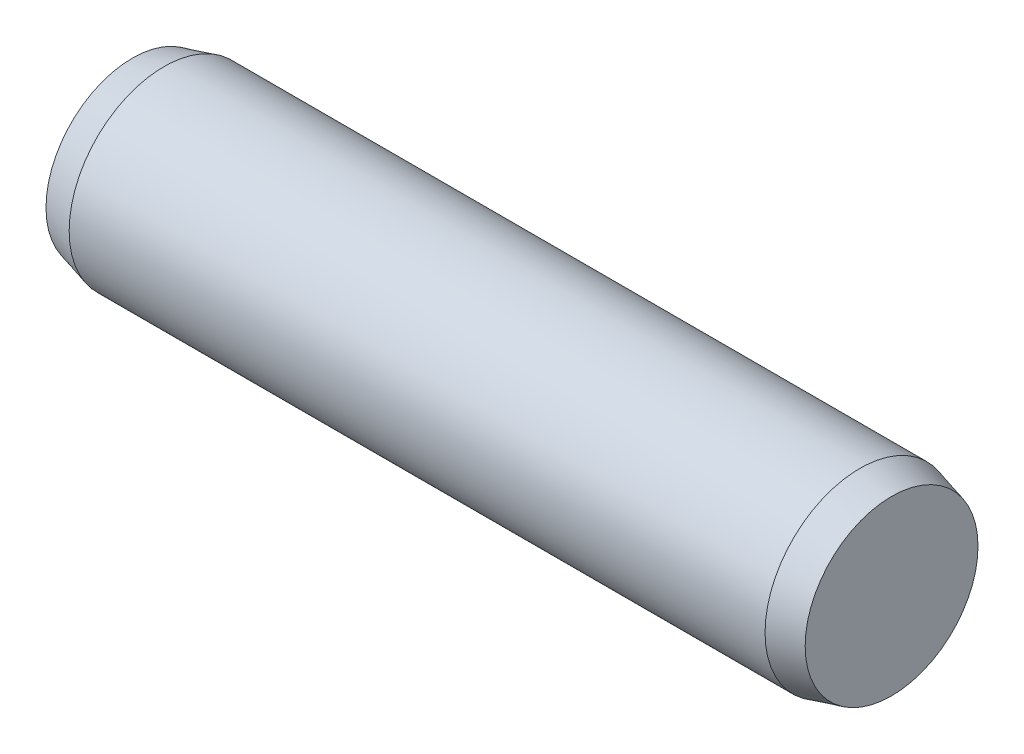
ISO-10303-21;
HEADER;
FILE_DESCRIPTION(('STEP AP214'),'2;1');
FILE_NAME('part.step','',(''),(''),'','','');
FILE_SCHEMA(('AUTOMOTIVE_DESIGN { 1 0 10303 214 1 1 1 1 }'));
ENDSEC;
DATA;
#1=APPLICATION_CONTEXT('core data for automotive mechanical design processes');
#2=APPLICATION_PROTOCOL_DEFINITION('international standard','automotive_design',2000,#1);
#3=PRODUCT_CONTEXT('',#1,'mechanical');
#4=PRODUCT('Part','Part','',(#3));
#5=PRODUCT_RELATED_PRODUCT_CATEGORY('part','',(#4));
#6=PRODUCT_DEFINITION_FORMATION('','',#4);
#7=PRODUCT_DEFINITION_CONTEXT('part definition',#1,'design');
#8=PRODUCT_DEFINITION('design','',#6,#7);
#9=PRODUCT_DEFINITION_SHAPE('','',#8);
#10=(LENGTH_UNIT() NAMED_UNIT(*) SI_UNIT(.MILLI.,.METRE.));
#11=(NAMED_UNIT(*) PLANE_ANGLE_UNIT() SI_UNIT($,.RADIAN.));
#12=(NAMED_UNIT(*) SI_UNIT($,.STERADIAN.) SOLID_ANGLE_UNIT());
#13=UNCERTAINTY_MEASURE_WITH_UNIT(LENGTH_MEASURE(1.E-05),#10,'distance_accuracy_value','');
#14=(GEOMETRIC_REPRESENTATION_CONTEXT(3) GLOBAL_UNCERTAINTY_ASSIGNED_CONTEXT((#13)) GLOBAL_UNIT_ASSIGNED_CONTEXT((#10,
#11,#12)) REPRESENTATION_CONTEXT('',''));
#15=CARTESIAN_POINT('',(0.,0.,0.));
#16=DIRECTION('',(0.,0.,1.));
#17=DIRECTION('',(1.,0.,0.));
#18=AXIS2_PLACEMENT_3D('',#15,#16,#17);
#19=CARTESIAN_POINT('',(-5.50000000000001,0.,0.));
#20=DIRECTION('',(1.,0.,0.));
#21=DIRECTION('',(0.,0.,-1.));
#22=AXIS2_PLACEMENT_3D('',#19,#20,#21);
#23=CYLINDRICAL_SURFACE('',#22,1.5);
#24=CARTESIAN_POINT('',(-5.50000000000001,0.,0.));
#25=DIRECTION('',(-1.,0.,0.));
#26=DIRECTION('',(0.,0.,1.));
#27=AXIS2_PLACEMENT_3D('',#24,#25,#26);
#28=CIRCLE('',#27,1.5);
#29=CARTESIAN_POINT('',(-5.50000000000001,0.,1.5));
#30=VERTEX_POINT('',#29);
#31=EDGE_CURVE('E53',#30,#30,#28,.T.);
#32=ORIENTED_EDGE('',*,*,#31,.F.);
#33=EDGE_LOOP('',(#32));
#34=FACE_BOUND('',#33,.T.);
#35=CARTESIAN_POINT('',(5.50000000000001,5.55111512312578E-13,-2.22044604925031E-13));
#36=DIRECTION('',(1.,0.,0.));
#37=DIRECTION('',(0.,0.,-1.));
#38=AXIS2_PLACEMENT_3D('',#35,#36,#37);
#39=CIRCLE('',#38,1.5);
#40=CARTESIAN_POINT('',(5.50000000000001,5.55111512312578E-13,-1.50000000000023));
#41=VERTEX_POINT('',#40);
#42=EDGE_CURVE('E10',#41,#41,#39,.T.);
#43=ORIENTED_EDGE('',*,*,#42,.F.);
#44=EDGE_LOOP('',(#43));
#45=FACE_BOUND('',#44,.T.);
#46=ADVANCED_FACE('F36',(#34,#45),#23,.T.);
#47=CARTESIAN_POINT('',(5.50000000000001,5.55111512312578E-13,-2.22044604925031E-13));
#48=DIRECTION('',(-1.,0.,0.));
#49=DIRECTION('',(0.,0.,-1.));
#50=AXIS2_PLACEMENT_3D('',#47,#48,#49);
#51=CONICAL_SURFACE('',#50,1.5,0.26179938779915);
#52=CARTESIAN_POINT('',(6.00000000000001,5.55111512312578E-13,-2.22044604925031E-13));
#53=DIRECTION('',(1.,0.,0.));
#54=DIRECTION('',(0.,0.,-1.));
#55=AXIS2_PLACEMENT_3D('',#52,#53,#54);
#56=CIRCLE('',#55,1.36602540378444);
#57=CARTESIAN_POINT('',(6.00000000000001,5.55111512312578E-13,-1.36602540378467));
#58=VERTEX_POINT('',#57);
#59=EDGE_CURVE('E43',#58,#58,#56,.T.);
#60=ORIENTED_EDGE('',*,*,#59,.F.);
#61=EDGE_LOOP('',(#60));
#62=FACE_BOUND('',#61,.T.);
#63=ORIENTED_EDGE('',*,*,#42,.T.);
#64=EDGE_LOOP('',(#63));
#65=FACE_BOUND('',#64,.T.);
#66=ADVANCED_FACE('F64',(#62,#65),#51,.T.);
#67=CARTESIAN_POINT('',(6.00000000000001,5.55111512312578E-13,-2.22044604925031E-13));
#68=DIRECTION('',(1.,0.,0.));
#69=DIRECTION('',(0.,0.,-1.));
#70=AXIS2_PLACEMENT_3D('',#67,#68,#69);
#71=PLANE('',#70);
#72=ORIENTED_EDGE('',*,*,#59,.T.);
#73=EDGE_LOOP('',(#72));
#74=FACE_BOUND('',#73,.T.);
#75=ADVANCED_FACE('F68',(#74),#71,.T.);
#76=CARTESIAN_POINT('',(-5.50000000000001,0.,0.));
#77=DIRECTION('',(1.,0.,0.));
#78=DIRECTION('',(0.,0.,1.));
#79=AXIS2_PLACEMENT_3D('',#76,#77,#78);
#80=CONICAL_SURFACE('',#79,1.5,0.26179938779915);
#81=CARTESIAN_POINT('',(-6.00000000000001,0.,0.));
#82=DIRECTION('',(-1.,0.,0.));
#83=DIRECTION('',(0.,0.,1.));
#84=AXIS2_PLACEMENT_3D('',#81,#82,#83);
#85=CIRCLE('',#84,1.36602540378444);
#86=CARTESIAN_POINT('',(-6.00000000000001,0.,1.36602540378444));
#87=VERTEX_POINT('',#86);
#88=EDGE_CURVE('E48',#87,#87,#85,.T.);
#89=ORIENTED_EDGE('',*,*,#88,.F.);
#90=EDGE_LOOP('',(#89));
#91=FACE_BOUND('',#90,.T.);
#92=ORIENTED_EDGE('',*,*,#31,.T.);
#93=EDGE_LOOP('',(#92));
#94=FACE_BOUND('',#93,.T.);
#95=ADVANCED_FACE('F60',(#91,#94),#80,.T.);
#96=CARTESIAN_POINT('',(-6.00000000000001,0.,0.));
#97=DIRECTION('',(-1.,0.,0.));
#98=DIRECTION('',(0.,0.,1.));
#99=AXIS2_PLACEMENT_3D('',#96,#97,#98);
#100=PLANE('',#99);
#101=ORIENTED_EDGE('',*,*,#88,.T.);
#102=EDGE_LOOP('',(#101));
#103=FACE_BOUND('',#102,.T.);
#104=ADVANCED_FACE('F77',(#103),#100,.T.);
#105=CLOSED_SHELL('',(#46,#66,#75,#95,#104));
#106=MANIFOLD_SOLID_BREP('B2',#105);
#107=ADVANCED_BREP_SHAPE_REPRESENTATION('',(#18,#106),#14);
#108=SHAPE_DEFINITION_REPRESENTATION(#9,#107);
ENDSEC;
END-ISO-10303-21;
